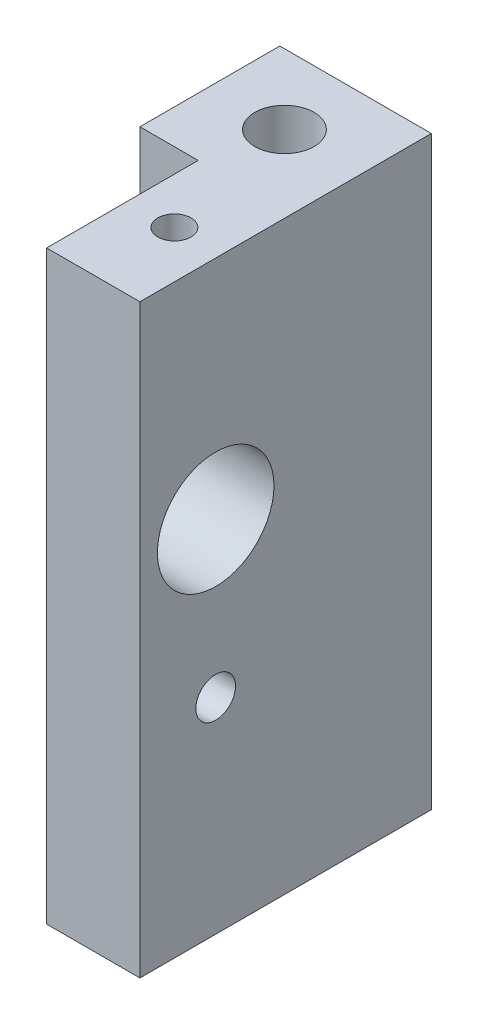
ISO-10303-21;
HEADER;
FILE_DESCRIPTION(('STEP AP214'),'2;1');
FILE_NAME('part.step','',(''),(''),'','','');
FILE_SCHEMA(('AUTOMOTIVE_DESIGN { 1 0 10303 214 1 1 1 1 }'));
ENDSEC;
DATA;
#1=APPLICATION_CONTEXT('core data for automotive mechanical design processes');
#2=APPLICATION_PROTOCOL_DEFINITION('international standard','automotive_design',2000,#1);
#3=PRODUCT_CONTEXT('',#1,'mechanical');
#4=PRODUCT('Part','Part','',(#3));
#5=PRODUCT_RELATED_PRODUCT_CATEGORY('part','',(#4));
#6=PRODUCT_DEFINITION_FORMATION('','',#4);
#7=PRODUCT_DEFINITION_CONTEXT('part definition',#1,'design');
#8=PRODUCT_DEFINITION('design','',#6,#7);
#9=PRODUCT_DEFINITION_SHAPE('','',#8);
#10=(LENGTH_UNIT() NAMED_UNIT(*) SI_UNIT(.MILLI.,.METRE.));
#11=(NAMED_UNIT(*) PLANE_ANGLE_UNIT() SI_UNIT($,.RADIAN.));
#12=(NAMED_UNIT(*) SI_UNIT($,.STERADIAN.) SOLID_ANGLE_UNIT());
#13=UNCERTAINTY_MEASURE_WITH_UNIT(LENGTH_MEASURE(1.E-05),#10,'distance_accuracy_value','');
#14=(GEOMETRIC_REPRESENTATION_CONTEXT(3) GLOBAL_UNCERTAINTY_ASSIGNED_CONTEXT((#13)) GLOBAL_UNIT_ASSIGNED_CONTEXT((#10,
#11,#12)) REPRESENTATION_CONTEXT('',''));
#15=CARTESIAN_POINT('',(0.,0.,0.));
#16=DIRECTION('',(0.,0.,1.));
#17=DIRECTION('',(1.,0.,0.));
#18=AXIS2_PLACEMENT_3D('',#15,#16,#17);
#19=CARTESIAN_POINT('',(0.,39.878,10.31875));
#20=DIRECTION('',(1.,0.,0.));
#21=DIRECTION('',(0.,0.,-1.));
#22=AXIS2_PLACEMENT_3D('',#19,#20,#21);
#23=PLANE('',#22);
#24=CARTESIAN_POINT('',(0.,24.4725400000061,5.159375));
#25=DIRECTION('',(1.,0.,0.));
#26=DIRECTION('',(0.,0.,-1.));
#27=AXIS2_PLACEMENT_3D('',#24,#25,#26);
#28=CIRCLE('',#27,3.96874999999959);
#29=CARTESIAN_POINT('',(0.,24.4725400000061,1.19062500000041));
#30=VERTEX_POINT('',#29);
#31=EDGE_CURVE('E217',#30,#30,#28,.F.);
#32=ORIENTED_EDGE('',*,*,#31,.F.);
#33=EDGE_LOOP('',(#32));
#34=FACE_BOUND('',#33,.T.);
#35=DIRECTION('',(0.,0.,1.));
#36=VECTOR('',#35,1.);
#37=CARTESIAN_POINT('',(0.,0.,10.31875));
#38=LINE('',#37,#36);
#39=CARTESIAN_POINT('',(0.,0.,0.));
#40=VERTEX_POINT('',#39);
#41=CARTESIAN_POINT('',(0.,0.,10.31875));
#42=VERTEX_POINT('',#41);
#43=EDGE_CURVE('E161',#40,#42,#38,.T.);
#44=ORIENTED_EDGE('',*,*,#43,.T.);
#45=DIRECTION('',(0.,-1.,0.));
#46=VECTOR('',#45,1.);
#47=CARTESIAN_POINT('',(0.,39.878,10.31875));
#48=LINE('',#47,#46);
#49=CARTESIAN_POINT('',(0.,39.878,10.31875));
#50=VERTEX_POINT('',#49);
#51=EDGE_CURVE('E11',#50,#42,#48,.T.);
#52=ORIENTED_EDGE('',*,*,#51,.F.);
#53=DIRECTION('',(0.,0.,1.));
#54=VECTOR('',#53,1.);
#55=CARTESIAN_POINT('',(0.,39.878,10.31875));
#56=LINE('',#55,#54);
#57=CARTESIAN_POINT('',(0.,39.878,0.));
#58=VERTEX_POINT('',#57);
#59=EDGE_CURVE('E177',#58,#50,#56,.T.);
#60=ORIENTED_EDGE('',*,*,#59,.F.);
#61=DIRECTION('',(0.,-1.,0.));
#62=VECTOR('',#61,1.);
#63=CARTESIAN_POINT('',(0.,39.878,0.));
#64=LINE('',#63,#62);
#65=EDGE_CURVE('E157',#58,#40,#64,.T.);
#66=ORIENTED_EDGE('',*,*,#65,.T.);
#67=EDGE_LOOP('',(#44,#52,#60,#66));
#68=FACE_BOUND('',#67,.T.);
#69=CARTESIAN_POINT('',(0.,13.97254,5.159375));
#70=DIRECTION('',(-1.,0.,0.));
#71=DIRECTION('',(0.,0.,1.));
#72=AXIS2_PLACEMENT_3D('',#69,#70,#71);
#73=CIRCLE('',#72,1.35255);
#74=CARTESIAN_POINT('',(0.,13.97254,6.511925));
#75=VERTEX_POINT('',#74);
#76=EDGE_CURVE('E220',#75,#75,#73,.T.);
#77=ORIENTED_EDGE('',*,*,#76,.F.);
#78=EDGE_LOOP('',(#77));
#79=FACE_BOUND('',#78,.T.);
#80=ADVANCED_FACE('F57',(#34,#68,#79),#23,.F.);
#81=CARTESIAN_POINT('',(6.35,39.878,10.31875));
#82=DIRECTION('',(0.,0.,-1.));
#83=DIRECTION('',(-1.,0.,0.));
#84=AXIS2_PLACEMENT_3D('',#81,#82,#83);
#85=PLANE('',#84);
#86=DIRECTION('',(1.,0.,0.));
#87=VECTOR('',#86,1.);
#88=CARTESIAN_POINT('',(6.35,0.,10.31875));
#89=LINE('',#88,#87);
#90=CARTESIAN_POINT('',(6.35,0.,10.31875));
#91=VERTEX_POINT('',#90);
#92=EDGE_CURVE('E165',#42,#91,#89,.T.);
#93=ORIENTED_EDGE('',*,*,#92,.T.);
#94=DIRECTION('',(0.,-1.,0.));
#95=VECTOR('',#94,1.);
#96=CARTESIAN_POINT('',(6.35,39.878,10.31875));
#97=LINE('',#96,#95);
#98=CARTESIAN_POINT('',(6.35,39.878,10.31875));
#99=VERTEX_POINT('',#98);
#100=EDGE_CURVE('E66',#99,#91,#97,.T.);
#101=ORIENTED_EDGE('',*,*,#100,.F.);
#102=DIRECTION('',(1.,0.,0.));
#103=VECTOR('',#102,1.);
#104=CARTESIAN_POINT('',(6.35,39.878,10.31875));
#105=LINE('',#104,#103);
#106=EDGE_CURVE('E121',#50,#99,#105,.T.);
#107=ORIENTED_EDGE('',*,*,#106,.F.);
#108=ORIENTED_EDGE('',*,*,#51,.T.);
#109=EDGE_LOOP('',(#93,#101,#107,#108));
#110=FACE_BOUND('',#109,.T.);
#111=ADVANCED_FACE('F210',(#110),#85,.F.);
#112=CARTESIAN_POINT('',(6.35,39.878,-9.525));
#113=DIRECTION('',(-1.,0.,0.));
#114=DIRECTION('',(0.,0.,1.));
#115=AXIS2_PLACEMENT_3D('',#112,#113,#114);
#116=PLANE('',#115);
#117=CARTESIAN_POINT('',(6.35,24.4725400000061,5.159375));
#118=DIRECTION('',(1.,0.,0.));
#119=DIRECTION('',(0.,0.,-1.));
#120=AXIS2_PLACEMENT_3D('',#117,#118,#119);
#121=CIRCLE('',#120,3.96874999999959);
#122=CARTESIAN_POINT('',(6.35,24.4725400000061,1.19062500000041));
#123=VERTEX_POINT('',#122);
#124=EDGE_CURVE('E221',#123,#123,#121,.T.);
#125=ORIENTED_EDGE('',*,*,#124,.F.);
#126=EDGE_LOOP('',(#125));
#127=FACE_BOUND('',#126,.T.);
#128=CARTESIAN_POINT('',(6.35,13.97254,5.159375));
#129=DIRECTION('',(-1.,0.,0.));
#130=DIRECTION('',(0.,0.,1.));
#131=AXIS2_PLACEMENT_3D('',#128,#129,#130);
#132=CIRCLE('',#131,1.35255);
#133=CARTESIAN_POINT('',(6.35,13.97254,6.511925));
#134=VERTEX_POINT('',#133);
#135=EDGE_CURVE('E225',#134,#134,#132,.T.);
#136=ORIENTED_EDGE('',*,*,#135,.T.);
#137=EDGE_LOOP('',(#136));
#138=FACE_BOUND('',#137,.T.);
#139=DIRECTION('',(0.,0.,-1.));
#140=VECTOR('',#139,1.);
#141=CARTESIAN_POINT('',(6.35,0.,-9.525));
#142=LINE('',#141,#140);
#143=CARTESIAN_POINT('',(6.35,0.,-9.525));
#144=VERTEX_POINT('',#143);
#145=EDGE_CURVE('E169',#91,#144,#142,.T.);
#146=ORIENTED_EDGE('',*,*,#145,.T.);
#147=DIRECTION('',(0.,-1.,0.));
#148=VECTOR('',#147,1.);
#149=CARTESIAN_POINT('',(6.35,39.878,-9.525));
#150=LINE('',#149,#148);
#151=CARTESIAN_POINT('',(6.35,39.878,-9.525));
#152=VERTEX_POINT('',#151);
#153=EDGE_CURVE('E149',#152,#144,#150,.T.);
#154=ORIENTED_EDGE('',*,*,#153,.F.);
#155=DIRECTION('',(0.,0.,-1.));
#156=VECTOR('',#155,1.);
#157=CARTESIAN_POINT('',(6.35,39.878,-9.525));
#158=LINE('',#157,#156);
#159=EDGE_CURVE('E138',#99,#152,#158,.T.);
#160=ORIENTED_EDGE('',*,*,#159,.F.);
#161=ORIENTED_EDGE('',*,*,#100,.T.);
#162=EDGE_LOOP('',(#146,#154,#160,#161));
#163=FACE_BOUND('',#162,.T.);
#164=ADVANCED_FACE('F188',(#127,#138,#163),#116,.F.);
#165=CARTESIAN_POINT('',(-3.96875,39.878,-9.525));
#166=DIRECTION('',(0.,0.,1.));
#167=DIRECTION('',(1.,0.,0.));
#168=AXIS2_PLACEMENT_3D('',#165,#166,#167);
#169=PLANE('',#168);
#170=DIRECTION('',(-1.,0.,0.));
#171=VECTOR('',#170,1.);
#172=CARTESIAN_POINT('',(-3.96875,0.,-9.525));
#173=LINE('',#172,#171);
#174=CARTESIAN_POINT('',(-3.96875,0.,-9.525));
#175=VERTEX_POINT('',#174);
#176=EDGE_CURVE('E147',#144,#175,#173,.T.);
#177=ORIENTED_EDGE('',*,*,#176,.T.);
#178=DIRECTION('',(0.,-1.,0.));
#179=VECTOR('',#178,1.);
#180=CARTESIAN_POINT('',(-3.96875,39.878,-9.525));
#181=LINE('',#180,#179);
#182=CARTESIAN_POINT('',(-3.96875,39.878,-9.525));
#183=VERTEX_POINT('',#182);
#184=EDGE_CURVE('E144',#183,#175,#181,.T.);
#185=ORIENTED_EDGE('',*,*,#184,.F.);
#186=DIRECTION('',(-1.,0.,0.));
#187=VECTOR('',#186,1.);
#188=CARTESIAN_POINT('',(-3.96875,39.878,-9.525));
#189=LINE('',#188,#187);
#190=EDGE_CURVE('E132',#152,#183,#189,.T.);
#191=ORIENTED_EDGE('',*,*,#190,.F.);
#192=ORIENTED_EDGE('',*,*,#153,.T.);
#193=EDGE_LOOP('',(#177,#185,#191,#192));
#194=FACE_BOUND('',#193,.T.);
#195=ADVANCED_FACE('F145',(#194),#169,.F.);
#196=CARTESIAN_POINT('',(-3.96875,39.878,0.));
#197=DIRECTION('',(1.,0.,0.));
#198=DIRECTION('',(0.,0.,-1.));
#199=AXIS2_PLACEMENT_3D('',#196,#197,#198);
#200=PLANE('',#199);
#201=DIRECTION('',(0.,0.,1.));
#202=VECTOR('',#201,1.);
#203=CARTESIAN_POINT('',(-3.96875,0.,0.));
#204=LINE('',#203,#202);
#205=CARTESIAN_POINT('',(-3.96875,0.,0.));
#206=VERTEX_POINT('',#205);
#207=EDGE_CURVE('E106',#175,#206,#204,.T.);
#208=ORIENTED_EDGE('',*,*,#207,.T.);
#209=DIRECTION('',(0.,-1.,0.));
#210=VECTOR('',#209,1.);
#211=CARTESIAN_POINT('',(-3.96875,39.878,0.));
#212=LINE('',#211,#210);
#213=CARTESIAN_POINT('',(-3.96875,39.878,0.));
#214=VERTEX_POINT('',#213);
#215=EDGE_CURVE('E150',#214,#206,#212,.T.);
#216=ORIENTED_EDGE('',*,*,#215,.F.);
#217=DIRECTION('',(0.,0.,1.));
#218=VECTOR('',#217,1.);
#219=CARTESIAN_POINT('',(-3.96875,39.878,0.));
#220=LINE('',#219,#218);
#221=EDGE_CURVE('E136',#183,#214,#220,.T.);
#222=ORIENTED_EDGE('',*,*,#221,.F.);
#223=ORIENTED_EDGE('',*,*,#184,.T.);
#224=EDGE_LOOP('',(#208,#216,#222,#223));
#225=FACE_BOUND('',#224,.T.);
#226=ADVANCED_FACE('F152',(#225),#200,.F.);
#227=CARTESIAN_POINT('',(0.,39.878,0.));
#228=DIRECTION('',(0.,0.,-1.));
#229=DIRECTION('',(-1.,0.,0.));
#230=AXIS2_PLACEMENT_3D('',#227,#228,#229);
#231=PLANE('',#230);
#232=DIRECTION('',(1.,0.,0.));
#233=VECTOR('',#232,1.);
#234=CARTESIAN_POINT('',(0.,0.,0.));
#235=LINE('',#234,#233);
#236=EDGE_CURVE('E113',#206,#40,#235,.T.);
#237=ORIENTED_EDGE('',*,*,#236,.T.);
#238=ORIENTED_EDGE('',*,*,#65,.F.);
#239=DIRECTION('',(1.,0.,0.));
#240=VECTOR('',#239,1.);
#241=CARTESIAN_POINT('',(0.,39.878,0.));
#242=LINE('',#241,#240);
#243=EDGE_CURVE('E77',#214,#58,#242,.T.);
#244=ORIENTED_EDGE('',*,*,#243,.F.);
#245=ORIENTED_EDGE('',*,*,#215,.T.);
#246=EDGE_LOOP('',(#237,#238,#244,#245));
#247=FACE_BOUND('',#246,.T.);
#248=ADVANCED_FACE('F196',(#247),#231,.F.);
#249=CARTESIAN_POINT('',(0.,39.878,0.));
#250=DIRECTION('',(0.,1.,0.));
#251=DIRECTION('',(0.,0.,1.));
#252=AXIS2_PLACEMENT_3D('',#249,#250,#251);
#253=PLANE('',#252);
#254=CARTESIAN_POINT('',(3.14325,39.878,4.7625));
#255=DIRECTION('',(0.,1.,0.));
#256=DIRECTION('',(0.,0.,1.));
#257=AXIS2_PLACEMENT_3D('',#254,#255,#256);
#258=CIRCLE('',#257,1.1303);
#259=CARTESIAN_POINT('',(3.14325,39.878,5.8928));
#260=VERTEX_POINT('',#259);
#261=EDGE_CURVE('E249',#260,#260,#258,.T.);
#262=ORIENTED_EDGE('',*,*,#261,.F.);
#263=EDGE_LOOP('',(#262));
#264=FACE_BOUND('',#263,.T.);
#265=CARTESIAN_POINT('',(1.11125,39.878,-4.7625));
#266=DIRECTION('',(0.,1.,0.));
#267=DIRECTION('',(0.,0.,1.));
#268=AXIS2_PLACEMENT_3D('',#265,#266,#267);
#269=CIRCLE('',#268,2.01929999999999);
#270=CARTESIAN_POINT('',(1.11125,39.878,-2.74320000000001));
#271=VERTEX_POINT('',#270);
#272=EDGE_CURVE('E236',#271,#271,#269,.T.);
#273=ORIENTED_EDGE('',*,*,#272,.F.);
#274=EDGE_LOOP('',(#273));
#275=FACE_BOUND('',#274,.T.);
#276=ORIENTED_EDGE('',*,*,#59,.T.);
#277=ORIENTED_EDGE('',*,*,#106,.T.);
#278=ORIENTED_EDGE('',*,*,#159,.T.);
#279=ORIENTED_EDGE('',*,*,#190,.T.);
#280=ORIENTED_EDGE('',*,*,#221,.T.);
#281=ORIENTED_EDGE('',*,*,#243,.T.);
#282=EDGE_LOOP('',(#276,#277,#278,#279,#280,#281));
#283=FACE_BOUND('',#282,.T.);
#284=ADVANCED_FACE('F134',(#264,#275,#283),#253,.T.);
#285=CARTESIAN_POINT('',(0.,0.,0.));
#286=DIRECTION('',(0.,1.,0.));
#287=DIRECTION('',(0.,0.,1.));
#288=AXIS2_PLACEMENT_3D('',#285,#286,#287);
#289=PLANE('',#288);
#290=CARTESIAN_POINT('',(1.11125,0.,-4.7625));
#291=DIRECTION('',(0.,1.,0.));
#292=DIRECTION('',(0.,0.,1.));
#293=AXIS2_PLACEMENT_3D('',#290,#291,#292);
#294=CIRCLE('',#293,2.01929999999999);
#295=CARTESIAN_POINT('',(1.11125,0.,-2.74320000000001));
#296=VERTEX_POINT('',#295);
#297=EDGE_CURVE('E166',#296,#296,#294,.T.);
#298=ORIENTED_EDGE('',*,*,#297,.T.);
#299=EDGE_LOOP('',(#298));
#300=FACE_BOUND('',#299,.T.);
#301=ORIENTED_EDGE('',*,*,#43,.F.);
#302=ORIENTED_EDGE('',*,*,#236,.F.);
#303=ORIENTED_EDGE('',*,*,#207,.F.);
#304=ORIENTED_EDGE('',*,*,#176,.F.);
#305=ORIENTED_EDGE('',*,*,#145,.F.);
#306=ORIENTED_EDGE('',*,*,#92,.F.);
#307=EDGE_LOOP('',(#301,#302,#303,#304,#305,#306));
#308=FACE_BOUND('',#307,.T.);
#309=ADVANCED_FACE('F191',(#300,#308),#289,.F.);
#310=CARTESIAN_POINT('',(1.11125,39.878,-4.7625));
#311=DIRECTION('',(0.,1.,0.));
#312=DIRECTION('',(0.,0.,1.));
#313=AXIS2_PLACEMENT_3D('',#310,#311,#312);
#314=CYLINDRICAL_SURFACE('',#313,2.01929999999999);
#315=ORIENTED_EDGE('',*,*,#297,.F.);
#316=EDGE_LOOP('',(#315));
#317=FACE_BOUND('',#316,.T.);
#318=ORIENTED_EDGE('',*,*,#272,.T.);
#319=EDGE_LOOP('',(#318));
#320=FACE_BOUND('',#319,.T.);
#321=ADVANCED_FACE('F258',(#317,#320),#314,.F.);
#322=CARTESIAN_POINT('',(0.,13.97254,5.159375));
#323=DIRECTION('',(-1.,0.,0.));
#324=DIRECTION('',(0.,0.,1.));
#325=AXIS2_PLACEMENT_3D('',#322,#323,#324);
#326=CYLINDRICAL_SURFACE('',#325,1.35255);
#327=ORIENTED_EDGE('',*,*,#135,.F.);
#328=EDGE_LOOP('',(#327));
#329=FACE_BOUND('',#328,.T.);
#330=ORIENTED_EDGE('',*,*,#76,.T.);
#331=EDGE_LOOP('',(#330));
#332=FACE_BOUND('',#331,.T.);
#333=ADVANCED_FACE('F260',(#329,#332),#326,.F.);
#334=CARTESIAN_POINT('',(-3.96975,24.4725400000061,5.159375));
#335=DIRECTION('',(1.,0.,0.));
#336=DIRECTION('',(0.,0.,-1.));
#337=AXIS2_PLACEMENT_3D('',#334,#335,#336);
#338=CYLINDRICAL_SURFACE('',#337,3.96874999999959);
#339=ORIENTED_EDGE('',*,*,#124,.T.);
#340=EDGE_LOOP('',(#339));
#341=FACE_BOUND('',#340,.T.);
#342=ORIENTED_EDGE('',*,*,#31,.T.);
#343=EDGE_LOOP('',(#342));
#344=FACE_BOUND('',#343,.T.);
#345=ADVANCED_FACE('F266',(#341,#344),#338,.F.);
#346=CARTESIAN_POINT('',(3.14325,33.528,4.7625));
#347=DIRECTION('',(0.,1.,0.));
#348=DIRECTION('',(0.,0.,1.));
#349=AXIS2_PLACEMENT_3D('',#346,#347,#348);
#350=CONICAL_SURFACE('',#349,1.1303,1.02974425867666);
#351=CARTESIAN_POINT('',(3.14325,32.8488472423132,4.7625));
#352=VERTEX_POINT('',#351);
#353=VERTEX_LOOP('',#352);
#354=FACE_BOUND('',#353,.T.);
#355=CARTESIAN_POINT('',(3.14325,33.528,4.7625));
#356=DIRECTION('',(0.,1.,0.));
#357=DIRECTION('',(0.,0.,1.));
#358=AXIS2_PLACEMENT_3D('',#355,#356,#357);
#359=CIRCLE('',#358,1.1303);
#360=CARTESIAN_POINT('',(3.14325,33.528,5.8928));
#361=VERTEX_POINT('',#360);
#362=EDGE_CURVE('E229',#361,#361,#359,.T.);
#363=ORIENTED_EDGE('',*,*,#362,.T.);
#364=EDGE_LOOP('',(#363));
#365=FACE_BOUND('',#364,.T.);
#366=ADVANCED_FACE('F274',(#354,#365),#350,.F.);
#367=CARTESIAN_POINT('',(3.14325,39.878,4.7625));
#368=DIRECTION('',(0.,1.,0.));
#369=DIRECTION('',(0.,0.,1.));
#370=AXIS2_PLACEMENT_3D('',#367,#368,#369);
#371=CYLINDRICAL_SURFACE('',#370,1.1303);
#372=ORIENTED_EDGE('',*,*,#362,.F.);
#373=EDGE_LOOP('',(#372));
#374=FACE_BOUND('',#373,.T.);
#375=ORIENTED_EDGE('',*,*,#261,.T.);
#376=EDGE_LOOP('',(#375));
#377=FACE_BOUND('',#376,.T.);
#378=ADVANCED_FACE('F254',(#374,#377),#371,.F.);
#379=CLOSED_SHELL('',(#80,#111,#164,#195,#226,#248,#284,#309,#321,#333,#345,#366,#378));
#380=MANIFOLD_SOLID_BREP('B2',#379);
#381=ADVANCED_BREP_SHAPE_REPRESENTATION('',(#18,#380),#14);
#382=SHAPE_DEFINITION_REPRESENTATION(#9,#381);
ENDSEC;
END-ISO-10303-21;
